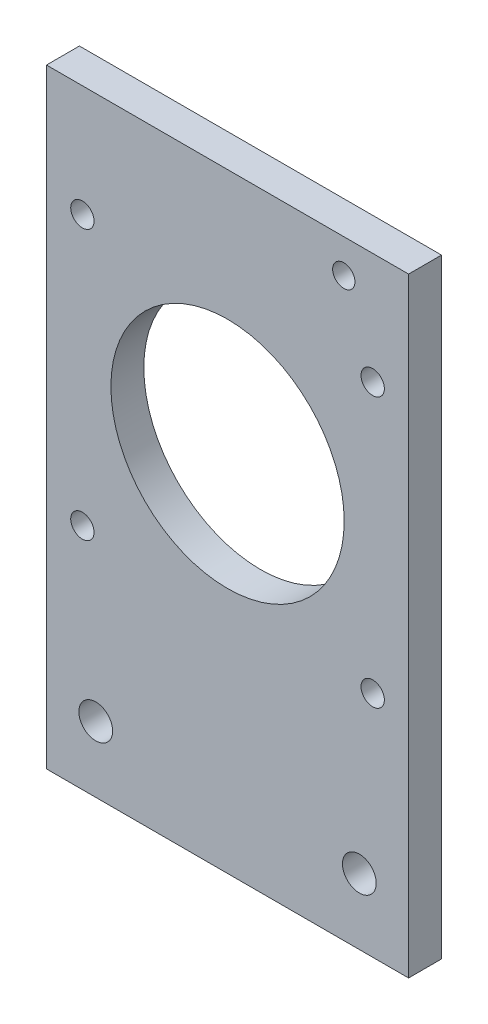
ISO-10303-21;
HEADER;
FILE_DESCRIPTION(('STEP AP214'),'2;1');
FILE_NAME('part.step','',(''),(''),'','','');
FILE_SCHEMA(('AUTOMOTIVE_DESIGN { 1 0 10303 214 1 1 1 1 }'));
ENDSEC;
DATA;
#1=APPLICATION_CONTEXT('core data for automotive mechanical design processes');
#2=APPLICATION_PROTOCOL_DEFINITION('international standard','automotive_design',2000,#1);
#3=PRODUCT_CONTEXT('',#1,'mechanical');
#4=PRODUCT('Part','Part','',(#3));
#5=PRODUCT_RELATED_PRODUCT_CATEGORY('part','',(#4));
#6=PRODUCT_DEFINITION_FORMATION('','',#4);
#7=PRODUCT_DEFINITION_CONTEXT('part definition',#1,'design');
#8=PRODUCT_DEFINITION('design','',#6,#7);
#9=PRODUCT_DEFINITION_SHAPE('','',#8);
#10=(LENGTH_UNIT() NAMED_UNIT(*) SI_UNIT(.MILLI.,.METRE.));
#11=(NAMED_UNIT(*) PLANE_ANGLE_UNIT() SI_UNIT($,.RADIAN.));
#12=(NAMED_UNIT(*) SI_UNIT($,.STERADIAN.) SOLID_ANGLE_UNIT());
#13=UNCERTAINTY_MEASURE_WITH_UNIT(LENGTH_MEASURE(1.E-05),#10,'distance_accuracy_value','');
#14=(GEOMETRIC_REPRESENTATION_CONTEXT(3) GLOBAL_UNCERTAINTY_ASSIGNED_CONTEXT((#13)) GLOBAL_UNIT_ASSIGNED_CONTEXT((#10,
#11,#12)) REPRESENTATION_CONTEXT('',''));
#15=CARTESIAN_POINT('',(0.,0.,0.));
#16=DIRECTION('',(0.,0.,1.));
#17=DIRECTION('',(1.,0.,0.));
#18=AXIS2_PLACEMENT_3D('',#15,#16,#17);
#19=CARTESIAN_POINT('',(0.,0.,3.175));
#20=DIRECTION('',(0.,0.,1.));
#21=DIRECTION('',(1.,0.,0.));
#22=AXIS2_PLACEMENT_3D('',#19,#20,#21);
#23=PLANE('',#22);
#24=CARTESIAN_POINT('',(-28.,96.1000000000001,3.175));
#25=DIRECTION('',(0.,0.,1.));
#26=DIRECTION('',(1.,0.,0.));
#27=AXIS2_PLACEMENT_3D('',#24,#25,#26);
#28=CIRCLE('',#27,2.25000000000001);
#29=CARTESIAN_POINT('',(-25.75,96.1000000000001,3.175));
#30=VERTEX_POINT('',#29);
#31=EDGE_CURVE('E299',#30,#30,#28,.T.);
#32=ORIENTED_EDGE('',*,*,#31,.F.);
#33=EDGE_LOOP('',(#32));
#34=FACE_BOUND('',#33,.T.);
#35=CARTESIAN_POINT('',(28.,44.1,3.175));
#36=DIRECTION('',(0.,0.,1.));
#37=DIRECTION('',(1.,0.,0.));
#38=AXIS2_PLACEMENT_3D('',#35,#36,#37);
#39=CIRCLE('',#38,2.25);
#40=CARTESIAN_POINT('',(30.25,44.1,3.175));
#41=VERTEX_POINT('',#40);
#42=EDGE_CURVE('E300',#41,#41,#39,.T.);
#43=ORIENTED_EDGE('',*,*,#42,.F.);
#44=EDGE_LOOP('',(#43));
#45=FACE_BOUND('',#44,.T.);
#46=CARTESIAN_POINT('',(-28.,44.1000000000001,3.175));
#47=DIRECTION('',(0.,0.,1.));
#48=DIRECTION('',(1.,0.,0.));
#49=AXIS2_PLACEMENT_3D('',#46,#47,#48);
#50=CIRCLE('',#49,2.25000000000001);
#51=CARTESIAN_POINT('',(-25.75,44.1000000000001,3.175));
#52=VERTEX_POINT('',#51);
#53=EDGE_CURVE('E303',#52,#52,#50,.T.);
#54=ORIENTED_EDGE('',*,*,#53,.F.);
#55=EDGE_LOOP('',(#54));
#56=FACE_BOUND('',#55,.T.);
#57=CARTESIAN_POINT('',(28.,96.1000000000001,3.175));
#58=DIRECTION('',(0.,0.,1.));
#59=DIRECTION('',(1.,0.,0.));
#60=AXIS2_PLACEMENT_3D('',#57,#58,#59);
#61=CIRCLE('',#60,2.25);
#62=CARTESIAN_POINT('',(30.25,96.1000000000001,3.175));
#63=VERTEX_POINT('',#62);
#64=EDGE_CURVE('E122',#63,#63,#61,.T.);
#65=ORIENTED_EDGE('',*,*,#64,.F.);
#66=EDGE_LOOP('',(#65));
#67=FACE_BOUND('',#66,.T.);
#68=CARTESIAN_POINT('',(-25.425,12.7,3.175));
#69=DIRECTION('',(0.,0.,1.));
#70=DIRECTION('',(1.,0.,0.));
#71=AXIS2_PLACEMENT_3D('',#68,#69,#70);
#72=CIRCLE('',#71,3.25755);
#73=CARTESIAN_POINT('',(-22.16745,12.7,3.175));
#74=VERTEX_POINT('',#73);
#75=EDGE_CURVE('E148',#74,#74,#72,.T.);
#76=ORIENTED_EDGE('',*,*,#75,.F.);
#77=EDGE_LOOP('',(#76));
#78=FACE_BOUND('',#77,.T.);
#79=CARTESIAN_POINT('',(25.425,12.7,3.175));
#80=DIRECTION('',(0.,0.,1.));
#81=DIRECTION('',(1.,0.,0.));
#82=AXIS2_PLACEMENT_3D('',#79,#80,#81);
#83=CIRCLE('',#82,3.25755);
#84=CARTESIAN_POINT('',(28.68255,12.7,3.175));
#85=VERTEX_POINT('',#84);
#86=EDGE_CURVE('E145',#85,#85,#83,.T.);
#87=ORIENTED_EDGE('',*,*,#86,.F.);
#88=EDGE_LOOP('',(#87));
#89=FACE_BOUND('',#88,.T.);
#90=CARTESIAN_POINT('',(22.425,111.1,3.175));
#91=DIRECTION('',(0.,0.,1.));
#92=DIRECTION('',(1.,0.,0.));
#93=AXIS2_PLACEMENT_3D('',#90,#91,#92);
#94=CIRCLE('',#93,2.15);
#95=CARTESIAN_POINT('',(24.575,111.1,3.175));
#96=VERTEX_POINT('',#95);
#97=EDGE_CURVE('E142',#96,#96,#94,.T.);
#98=ORIENTED_EDGE('',*,*,#97,.F.);
#99=EDGE_LOOP('',(#98));
#100=FACE_BOUND('',#99,.T.);
#101=DIRECTION('',(0.,-1.,0.));
#102=VECTOR('',#101,1.);
#103=CARTESIAN_POINT('',(-34.925,0.,3.175));
#104=LINE('',#103,#102);
#105=CARTESIAN_POINT('',(-34.925,117.6,3.175));
#106=VERTEX_POINT('',#105);
#107=CARTESIAN_POINT('',(-34.925,0.,3.175));
#108=VERTEX_POINT('',#107);
#109=EDGE_CURVE('E61',#106,#108,#104,.T.);
#110=ORIENTED_EDGE('',*,*,#109,.T.);
#111=DIRECTION('',(1.,0.,0.));
#112=VECTOR('',#111,1.);
#113=CARTESIAN_POINT('',(-34.925,0.,3.175));
#114=LINE('',#113,#112);
#115=CARTESIAN_POINT('',(34.925,0.,3.175));
#116=VERTEX_POINT('',#115);
#117=EDGE_CURVE('E92',#108,#116,#114,.T.);
#118=ORIENTED_EDGE('',*,*,#117,.T.);
#119=DIRECTION('',(0.,1.,0.));
#120=VECTOR('',#119,1.);
#121=CARTESIAN_POINT('',(34.925,0.,3.175));
#122=LINE('',#121,#120);
#123=CARTESIAN_POINT('',(34.925,117.6,3.175));
#124=VERTEX_POINT('',#123);
#125=EDGE_CURVE('E96',#116,#124,#122,.T.);
#126=ORIENTED_EDGE('',*,*,#125,.T.);
#127=DIRECTION('',(-1.,0.,0.));
#128=VECTOR('',#127,1.);
#129=CARTESIAN_POINT('',(34.925,117.6,3.175));
#130=LINE('',#129,#128);
#131=EDGE_CURVE('E104',#124,#106,#130,.T.);
#132=ORIENTED_EDGE('',*,*,#131,.T.);
#133=EDGE_LOOP('',(#110,#118,#126,#132));
#134=FACE_BOUND('',#133,.T.);
#135=CARTESIAN_POINT('',(0.,70.1,3.175));
#136=DIRECTION('',(0.,0.,1.));
#137=DIRECTION('',(1.,0.,0.));
#138=AXIS2_PLACEMENT_3D('',#135,#136,#137);
#139=CIRCLE('',#138,22.5);
#140=CARTESIAN_POINT('',(22.5,70.1,3.175));
#141=VERTEX_POINT('',#140);
#142=EDGE_CURVE('E111',#141,#141,#139,.T.);
#143=ORIENTED_EDGE('',*,*,#142,.F.);
#144=EDGE_LOOP('',(#143));
#145=FACE_BOUND('',#144,.T.);
#146=ADVANCED_FACE('F42',(#34,#45,#56,#67,#78,#89,#100,#134,#145),#23,.T.);
#147=CARTESIAN_POINT('',(0.,0.,-3.175));
#148=DIRECTION('',(0.,0.,1.));
#149=DIRECTION('',(1.,0.,0.));
#150=AXIS2_PLACEMENT_3D('',#147,#148,#149);
#151=PLANE('',#150);
#152=CARTESIAN_POINT('',(-28.,96.1000000000001,-3.175));
#153=DIRECTION('',(0.,0.,1.));
#154=DIRECTION('',(1.,0.,0.));
#155=AXIS2_PLACEMENT_3D('',#152,#153,#154);
#156=CIRCLE('',#155,2.25000000000001);
#157=CARTESIAN_POINT('',(-25.75,96.1000000000001,-3.175));
#158=VERTEX_POINT('',#157);
#159=EDGE_CURVE('E46',#158,#158,#156,.T.);
#160=ORIENTED_EDGE('',*,*,#159,.T.);
#161=EDGE_LOOP('',(#160));
#162=FACE_BOUND('',#161,.T.);
#163=CARTESIAN_POINT('',(28.,44.1,-3.175));
#164=DIRECTION('',(0.,0.,1.));
#165=DIRECTION('',(1.,0.,0.));
#166=AXIS2_PLACEMENT_3D('',#163,#164,#165);
#167=CIRCLE('',#166,2.25);
#168=CARTESIAN_POINT('',(30.25,44.1,-3.175));
#169=VERTEX_POINT('',#168);
#170=EDGE_CURVE('E124',#169,#169,#167,.T.);
#171=ORIENTED_EDGE('',*,*,#170,.T.);
#172=EDGE_LOOP('',(#171));
#173=FACE_BOUND('',#172,.T.);
#174=CARTESIAN_POINT('',(-28.,44.1000000000001,-3.175));
#175=DIRECTION('',(0.,0.,1.));
#176=DIRECTION('',(1.,0.,0.));
#177=AXIS2_PLACEMENT_3D('',#174,#175,#176);
#178=CIRCLE('',#177,2.25000000000001);
#179=CARTESIAN_POINT('',(-25.75,44.1000000000001,-3.175));
#180=VERTEX_POINT('',#179);
#181=EDGE_CURVE('E121',#180,#180,#178,.T.);
#182=ORIENTED_EDGE('',*,*,#181,.T.);
#183=EDGE_LOOP('',(#182));
#184=FACE_BOUND('',#183,.T.);
#185=CARTESIAN_POINT('',(28.,96.1000000000001,-3.175));
#186=DIRECTION('',(0.,0.,1.));
#187=DIRECTION('',(1.,0.,0.));
#188=AXIS2_PLACEMENT_3D('',#185,#186,#187);
#189=CIRCLE('',#188,2.25);
#190=CARTESIAN_POINT('',(30.25,96.1000000000001,-3.175));
#191=VERTEX_POINT('',#190);
#192=EDGE_CURVE('E118',#191,#191,#189,.T.);
#193=ORIENTED_EDGE('',*,*,#192,.T.);
#194=EDGE_LOOP('',(#193));
#195=FACE_BOUND('',#194,.T.);
#196=CARTESIAN_POINT('',(-25.425,12.7,-3.175));
#197=DIRECTION('',(0.,0.,1.));
#198=DIRECTION('',(1.,0.,0.));
#199=AXIS2_PLACEMENT_3D('',#196,#197,#198);
#200=CIRCLE('',#199,3.25755);
#201=CARTESIAN_POINT('',(-22.16745,12.7,-3.175));
#202=VERTEX_POINT('',#201);
#203=EDGE_CURVE('E138',#202,#202,#200,.T.);
#204=ORIENTED_EDGE('',*,*,#203,.T.);
#205=EDGE_LOOP('',(#204));
#206=FACE_BOUND('',#205,.T.);
#207=CARTESIAN_POINT('',(25.425,12.7,-3.175));
#208=DIRECTION('',(0.,0.,1.));
#209=DIRECTION('',(1.,0.,0.));
#210=AXIS2_PLACEMENT_3D('',#207,#208,#209);
#211=CIRCLE('',#210,3.25755);
#212=CARTESIAN_POINT('',(28.68255,12.7,-3.175));
#213=VERTEX_POINT('',#212);
#214=EDGE_CURVE('E133',#213,#213,#211,.T.);
#215=ORIENTED_EDGE('',*,*,#214,.T.);
#216=EDGE_LOOP('',(#215));
#217=FACE_BOUND('',#216,.T.);
#218=CARTESIAN_POINT('',(22.425,111.1,-3.175));
#219=DIRECTION('',(0.,0.,1.));
#220=DIRECTION('',(1.,0.,0.));
#221=AXIS2_PLACEMENT_3D('',#218,#219,#220);
#222=CIRCLE('',#221,2.15);
#223=CARTESIAN_POINT('',(24.575,111.1,-3.175));
#224=VERTEX_POINT('',#223);
#225=EDGE_CURVE('E129',#224,#224,#222,.T.);
#226=ORIENTED_EDGE('',*,*,#225,.T.);
#227=EDGE_LOOP('',(#226));
#228=FACE_BOUND('',#227,.T.);
#229=DIRECTION('',(1.,0.,0.));
#230=VECTOR('',#229,1.);
#231=CARTESIAN_POINT('',(-34.925,0.,-3.175));
#232=LINE('',#231,#230);
#233=CARTESIAN_POINT('',(-34.925,0.,-3.175));
#234=VERTEX_POINT('',#233);
#235=CARTESIAN_POINT('',(34.925,0.,-3.175));
#236=VERTEX_POINT('',#235);
#237=EDGE_CURVE('E99',#234,#236,#232,.T.);
#238=ORIENTED_EDGE('',*,*,#237,.F.);
#239=DIRECTION('',(0.,-1.,0.));
#240=VECTOR('',#239,1.);
#241=CARTESIAN_POINT('',(-34.925,102.6,-3.175));
#242=LINE('',#241,#240);
#243=CARTESIAN_POINT('',(-34.925,117.6,-3.175));
#244=VERTEX_POINT('',#243);
#245=EDGE_CURVE('E85',#244,#234,#242,.T.);
#246=ORIENTED_EDGE('',*,*,#245,.F.);
#247=DIRECTION('',(-1.,0.,0.));
#248=VECTOR('',#247,1.);
#249=CARTESIAN_POINT('',(34.925,117.6,-3.175));
#250=LINE('',#249,#248);
#251=CARTESIAN_POINT('',(34.925,117.6,-3.175));
#252=VERTEX_POINT('',#251);
#253=EDGE_CURVE('E113',#252,#244,#250,.T.);
#254=ORIENTED_EDGE('',*,*,#253,.F.);
#255=DIRECTION('',(0.,1.,0.));
#256=VECTOR('',#255,1.);
#257=CARTESIAN_POINT('',(34.925,102.6,-3.175));
#258=LINE('',#257,#256);
#259=EDGE_CURVE('E78',#236,#252,#258,.T.);
#260=ORIENTED_EDGE('',*,*,#259,.F.);
#261=EDGE_LOOP('',(#238,#246,#254,#260));
#262=FACE_BOUND('',#261,.T.);
#263=CARTESIAN_POINT('',(0.,70.1,-3.175));
#264=DIRECTION('',(0.,0.,1.));
#265=DIRECTION('',(1.,0.,0.));
#266=AXIS2_PLACEMENT_3D('',#263,#264,#265);
#267=CIRCLE('',#266,22.5);
#268=CARTESIAN_POINT('',(22.5,70.1,-3.175));
#269=VERTEX_POINT('',#268);
#270=EDGE_CURVE('E151',#269,#269,#267,.T.);
#271=ORIENTED_EDGE('',*,*,#270,.T.);
#272=EDGE_LOOP('',(#271));
#273=FACE_BOUND('',#272,.T.);
#274=ADVANCED_FACE('F157',(#162,#173,#184,#195,#206,#217,#228,#262,#273),#151,.F.);
#275=CARTESIAN_POINT('',(-34.925,0.,3.175));
#276=DIRECTION('',(0.,1.,0.));
#277=DIRECTION('',(-1.,0.,0.));
#278=AXIS2_PLACEMENT_3D('',#275,#276,#277);
#279=PLANE('',#278);
#280=ORIENTED_EDGE('',*,*,#237,.T.);
#281=DIRECTION('',(0.,0.,-1.));
#282=VECTOR('',#281,1.);
#283=CARTESIAN_POINT('',(34.925,0.,3.175));
#284=LINE('',#283,#282);
#285=EDGE_CURVE('E52',#116,#236,#284,.T.);
#286=ORIENTED_EDGE('',*,*,#285,.F.);
#287=ORIENTED_EDGE('',*,*,#117,.F.);
#288=DIRECTION('',(0.,0.,-1.));
#289=VECTOR('',#288,1.);
#290=CARTESIAN_POINT('',(-34.925,0.,3.175));
#291=LINE('',#290,#289);
#292=EDGE_CURVE('E11',#108,#234,#291,.T.);
#293=ORIENTED_EDGE('',*,*,#292,.T.);
#294=EDGE_LOOP('',(#280,#286,#287,#293));
#295=FACE_BOUND('',#294,.T.);
#296=ADVANCED_FACE('F44',(#295),#279,.F.);
#297=CARTESIAN_POINT('',(34.925,102.6,3.175));
#298=DIRECTION('',(-1.,0.,0.));
#299=DIRECTION('',(0.,0.,1.));
#300=AXIS2_PLACEMENT_3D('',#297,#298,#299);
#301=PLANE('',#300);
#302=ORIENTED_EDGE('',*,*,#259,.T.);
#303=DIRECTION('',(0.,0.,-1.));
#304=VECTOR('',#303,1.);
#305=CARTESIAN_POINT('',(34.925,117.6,3.175));
#306=LINE('',#305,#304);
#307=EDGE_CURVE('E100',#124,#252,#306,.T.);
#308=ORIENTED_EDGE('',*,*,#307,.F.);
#309=ORIENTED_EDGE('',*,*,#125,.F.);
#310=ORIENTED_EDGE('',*,*,#285,.T.);
#311=EDGE_LOOP('',(#302,#308,#309,#310));
#312=FACE_BOUND('',#311,.T.);
#313=ADVANCED_FACE('F102',(#312),#301,.F.);
#314=CARTESIAN_POINT('',(34.925,117.6,3.175));
#315=DIRECTION('',(0.,-1.,0.));
#316=DIRECTION('',(0.,0.,-1.));
#317=AXIS2_PLACEMENT_3D('',#314,#315,#316);
#318=PLANE('',#317);
#319=ORIENTED_EDGE('',*,*,#253,.T.);
#320=DIRECTION('',(0.,0.,-1.));
#321=VECTOR('',#320,1.);
#322=CARTESIAN_POINT('',(-34.925,117.6,3.175));
#323=LINE('',#322,#321);
#324=EDGE_CURVE('E106',#106,#244,#323,.T.);
#325=ORIENTED_EDGE('',*,*,#324,.F.);
#326=ORIENTED_EDGE('',*,*,#131,.F.);
#327=ORIENTED_EDGE('',*,*,#307,.T.);
#328=EDGE_LOOP('',(#319,#325,#326,#327));
#329=FACE_BOUND('',#328,.T.);
#330=ADVANCED_FACE('F172',(#329),#318,.F.);
#331=CARTESIAN_POINT('',(-34.925,102.6,3.175));
#332=DIRECTION('',(1.,0.,0.));
#333=DIRECTION('',(0.,1.,0.));
#334=AXIS2_PLACEMENT_3D('',#331,#332,#333);
#335=PLANE('',#334);
#336=ORIENTED_EDGE('',*,*,#245,.T.);
#337=ORIENTED_EDGE('',*,*,#292,.F.);
#338=ORIENTED_EDGE('',*,*,#109,.F.);
#339=ORIENTED_EDGE('',*,*,#324,.T.);
#340=EDGE_LOOP('',(#336,#337,#338,#339));
#341=FACE_BOUND('',#340,.T.);
#342=ADVANCED_FACE('F162',(#341),#335,.F.);
#343=CARTESIAN_POINT('',(0.,70.1,3.175));
#344=DIRECTION('',(0.,0.,-1.));
#345=DIRECTION('',(-1.,0.,0.));
#346=AXIS2_PLACEMENT_3D('',#343,#344,#345);
#347=CYLINDRICAL_SURFACE('',#346,22.5);
#348=ORIENTED_EDGE('',*,*,#142,.T.);
#349=EDGE_LOOP('',(#348));
#350=FACE_BOUND('',#349,.T.);
#351=ORIENTED_EDGE('',*,*,#270,.F.);
#352=EDGE_LOOP('',(#351));
#353=FACE_BOUND('',#352,.T.);
#354=ADVANCED_FACE('F159',(#350,#353),#347,.F.);
#355=CARTESIAN_POINT('',(22.425,111.1,-3.175));
#356=DIRECTION('',(0.,0.,1.));
#357=DIRECTION('',(1.,0.,0.));
#358=AXIS2_PLACEMENT_3D('',#355,#356,#357);
#359=CYLINDRICAL_SURFACE('',#358,2.15);
#360=ORIENTED_EDGE('',*,*,#97,.T.);
#361=EDGE_LOOP('',(#360));
#362=FACE_BOUND('',#361,.T.);
#363=ORIENTED_EDGE('',*,*,#225,.F.);
#364=EDGE_LOOP('',(#363));
#365=FACE_BOUND('',#364,.T.);
#366=ADVANCED_FACE('F161',(#362,#365),#359,.F.);
#367=CARTESIAN_POINT('',(25.425,12.7,-3.175));
#368=DIRECTION('',(0.,0.,1.));
#369=DIRECTION('',(1.,0.,0.));
#370=AXIS2_PLACEMENT_3D('',#367,#368,#369);
#371=CYLINDRICAL_SURFACE('',#370,3.25755);
#372=ORIENTED_EDGE('',*,*,#86,.T.);
#373=EDGE_LOOP('',(#372));
#374=FACE_BOUND('',#373,.T.);
#375=ORIENTED_EDGE('',*,*,#214,.F.);
#376=EDGE_LOOP('',(#375));
#377=FACE_BOUND('',#376,.T.);
#378=ADVANCED_FACE('F169',(#374,#377),#371,.F.);
#379=CARTESIAN_POINT('',(-25.425,12.7,-3.175));
#380=DIRECTION('',(0.,0.,1.));
#381=DIRECTION('',(1.,0.,0.));
#382=AXIS2_PLACEMENT_3D('',#379,#380,#381);
#383=CYLINDRICAL_SURFACE('',#382,3.25755);
#384=ORIENTED_EDGE('',*,*,#75,.T.);
#385=EDGE_LOOP('',(#384));
#386=FACE_BOUND('',#385,.T.);
#387=ORIENTED_EDGE('',*,*,#203,.F.);
#388=EDGE_LOOP('',(#387));
#389=FACE_BOUND('',#388,.T.);
#390=ADVANCED_FACE('F245',(#386,#389),#383,.F.);
#391=CARTESIAN_POINT('',(28.,96.1000000000001,-6.825));
#392=DIRECTION('',(0.,0.,1.));
#393=DIRECTION('',(1.,0.,0.));
#394=AXIS2_PLACEMENT_3D('',#391,#392,#393);
#395=CYLINDRICAL_SURFACE('',#394,2.25);
#396=ORIENTED_EDGE('',*,*,#64,.T.);
#397=EDGE_LOOP('',(#396));
#398=FACE_BOUND('',#397,.T.);
#399=ORIENTED_EDGE('',*,*,#192,.F.);
#400=EDGE_LOOP('',(#399));
#401=FACE_BOUND('',#400,.T.);
#402=ADVANCED_FACE('F254',(#398,#401),#395,.F.);
#403=CARTESIAN_POINT('',(-28.,44.1000000000001,-6.825));
#404=DIRECTION('',(0.,0.,1.));
#405=DIRECTION('',(1.,0.,0.));
#406=AXIS2_PLACEMENT_3D('',#403,#404,#405);
#407=CYLINDRICAL_SURFACE('',#406,2.25000000000001);
#408=ORIENTED_EDGE('',*,*,#53,.T.);
#409=EDGE_LOOP('',(#408));
#410=FACE_BOUND('',#409,.T.);
#411=ORIENTED_EDGE('',*,*,#181,.F.);
#412=EDGE_LOOP('',(#411));
#413=FACE_BOUND('',#412,.T.);
#414=ADVANCED_FACE('F264',(#410,#413),#407,.F.);
#415=CARTESIAN_POINT('',(28.,44.1,-6.825));
#416=DIRECTION('',(0.,0.,1.));
#417=DIRECTION('',(1.,0.,0.));
#418=AXIS2_PLACEMENT_3D('',#415,#416,#417);
#419=CYLINDRICAL_SURFACE('',#418,2.25);
#420=ORIENTED_EDGE('',*,*,#42,.T.);
#421=EDGE_LOOP('',(#420));
#422=FACE_BOUND('',#421,.T.);
#423=ORIENTED_EDGE('',*,*,#170,.F.);
#424=EDGE_LOOP('',(#423));
#425=FACE_BOUND('',#424,.T.);
#426=ADVANCED_FACE('F274',(#422,#425),#419,.F.);
#427=CARTESIAN_POINT('',(-28.,96.1000000000001,-6.825));
#428=DIRECTION('',(0.,0.,1.));
#429=DIRECTION('',(1.,0.,0.));
#430=AXIS2_PLACEMENT_3D('',#427,#428,#429);
#431=CYLINDRICAL_SURFACE('',#430,2.25000000000001);
#432=ORIENTED_EDGE('',*,*,#31,.T.);
#433=EDGE_LOOP('',(#432));
#434=FACE_BOUND('',#433,.T.);
#435=ORIENTED_EDGE('',*,*,#159,.F.);
#436=EDGE_LOOP('',(#435));
#437=FACE_BOUND('',#436,.T.);
#438=ADVANCED_FACE('F284',(#434,#437),#431,.F.);
#439=CLOSED_SHELL('',(#146,#274,#296,#313,#330,#342,#354,#366,#378,#390,#402,#414,#426,#438));
#440=MANIFOLD_SOLID_BREP('B2',#439);
#441=ADVANCED_BREP_SHAPE_REPRESENTATION('',(#18,#440),#14);
#442=SHAPE_DEFINITION_REPRESENTATION(#9,#441);
ENDSEC;
END-ISO-10303-21;
